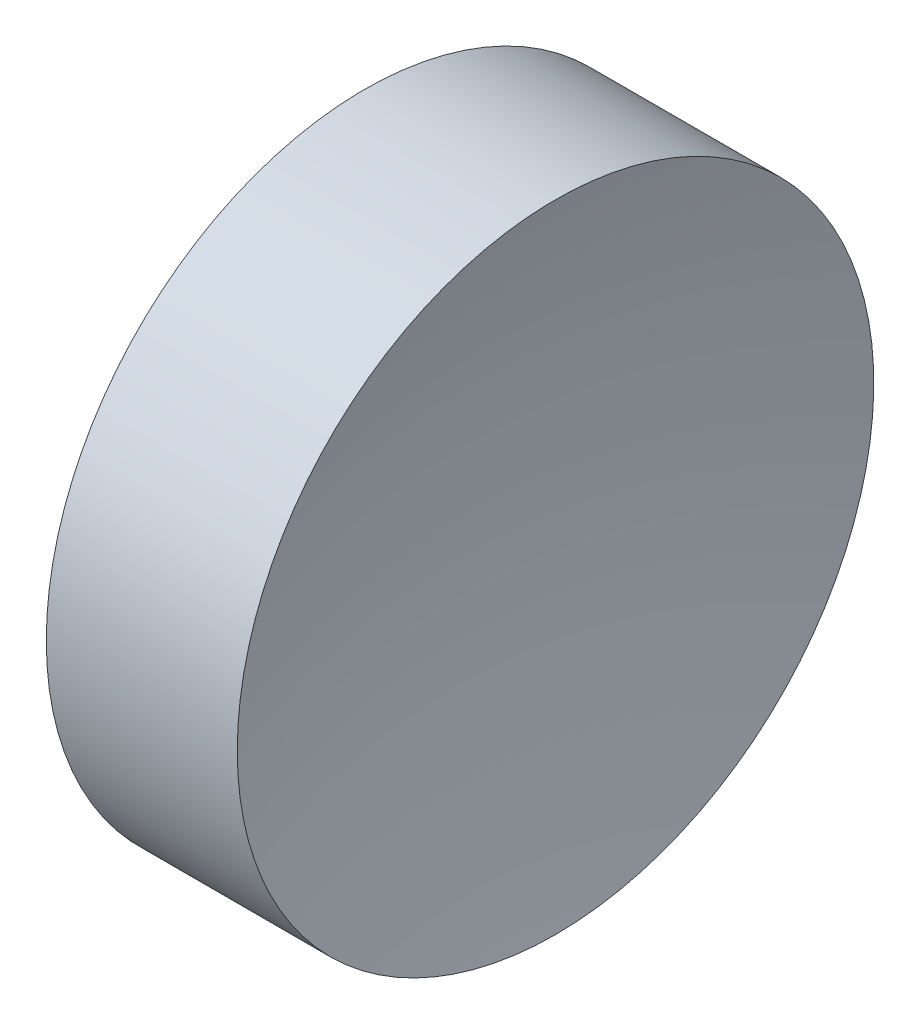
ISO-10303-21;
HEADER;
FILE_DESCRIPTION(('STEP AP214'),'2;1');
FILE_NAME('part.step','',(''),(''),'','','');
FILE_SCHEMA(('AUTOMOTIVE_DESIGN { 1 0 10303 214 1 1 1 1 }'));
ENDSEC;
DATA;
#1=APPLICATION_CONTEXT('core data for automotive mechanical design processes');
#2=APPLICATION_PROTOCOL_DEFINITION('international standard','automotive_design',2000,#1);
#3=PRODUCT_CONTEXT('',#1,'mechanical');
#4=PRODUCT('Part','Part','',(#3));
#5=PRODUCT_RELATED_PRODUCT_CATEGORY('part','',(#4));
#6=PRODUCT_DEFINITION_FORMATION('','',#4);
#7=PRODUCT_DEFINITION_CONTEXT('part definition',#1,'design');
#8=PRODUCT_DEFINITION('design','',#6,#7);
#9=PRODUCT_DEFINITION_SHAPE('','',#8);
#10=(LENGTH_UNIT() NAMED_UNIT(*) SI_UNIT(.MILLI.,.METRE.));
#11=(NAMED_UNIT(*) PLANE_ANGLE_UNIT() SI_UNIT($,.RADIAN.));
#12=(NAMED_UNIT(*) SI_UNIT($,.STERADIAN.) SOLID_ANGLE_UNIT());
#13=UNCERTAINTY_MEASURE_WITH_UNIT(LENGTH_MEASURE(1.E-05),#10,'distance_accuracy_value','');
#14=(GEOMETRIC_REPRESENTATION_CONTEXT(3) GLOBAL_UNCERTAINTY_ASSIGNED_CONTEXT((#13)) GLOBAL_UNIT_ASSIGNED_CONTEXT((#10,
#11,#12)) REPRESENTATION_CONTEXT('',''));
#15=CARTESIAN_POINT('',(0.,0.,0.));
#16=DIRECTION('',(0.,0.,1.));
#17=DIRECTION('',(1.,0.,0.));
#18=AXIS2_PLACEMENT_3D('',#15,#16,#17);
#19=CARTESIAN_POINT('',(36.7192688325745,13.031126091403,0.));
#20=DIRECTION('',(-1.,0.,0.));
#21=DIRECTION('',(0.,-1.,0.));
#22=AXIS2_PLACEMENT_3D('',#19,#20,#21);
#23=SPHERICAL_SURFACE('',#22,12.91);
#24=CARTESIAN_POINT('',(24.1994605273328,13.031126091403,0.));
#25=DIRECTION('',(-1.,0.,0.));
#26=DIRECTION('',(0.,0.,1.));
#27=AXIS2_PLACEMENT_3D('',#24,#25,#26);
#28=CIRCLE('',#27,3.15);
#29=CARTESIAN_POINT('',(24.1994605273328,13.031126091403,3.15));
#30=VERTEX_POINT('',#29);
#31=EDGE_CURVE('E10',#30,#30,#28,.T.);
#32=ORIENTED_EDGE('',*,*,#31,.F.);
#33=EDGE_LOOP('',(#32));
#34=FACE_BOUND('',#33,.T.);
#35=ADVANCED_FACE('F35',(#34),#23,.F.);
#36=CARTESIAN_POINT('',(20.6840306351329,13.031126091403,0.));
#37=DIRECTION('',(-1.,0.,0.));
#38=DIRECTION('',(0.,0.,1.));
#39=AXIS2_PLACEMENT_3D('',#36,#37,#38);
#40=CYLINDRICAL_SURFACE('',#39,3.15);
#41=CARTESIAN_POINT('',(22.3092688325745,13.031126091403,0.));
#42=DIRECTION('',(-1.,0.,0.));
#43=DIRECTION('',(0.,0.,1.));
#44=AXIS2_PLACEMENT_3D('',#41,#42,#43);
#45=CIRCLE('',#44,3.15);
#46=CARTESIAN_POINT('',(22.3092688325745,13.031126091403,3.15));
#47=VERTEX_POINT('',#46);
#48=EDGE_CURVE('E41',#47,#47,#45,.T.);
#49=ORIENTED_EDGE('',*,*,#48,.F.);
#50=EDGE_LOOP('',(#49));
#51=FACE_BOUND('',#50,.T.);
#52=ORIENTED_EDGE('',*,*,#31,.T.);
#53=EDGE_LOOP('',(#52));
#54=FACE_BOUND('',#53,.T.);
#55=ADVANCED_FACE('F49',(#51,#54),#40,.T.);
#56=CARTESIAN_POINT('',(22.3092688325745,13.031126091403,0.));
#57=DIRECTION('',(1.,0.,0.));
#58=DIRECTION('',(0.,0.,-1.));
#59=AXIS2_PLACEMENT_3D('',#56,#57,#58);
#60=PLANE('',#59);
#61=ORIENTED_EDGE('',*,*,#48,.T.);
#62=EDGE_LOOP('',(#61));
#63=FACE_BOUND('',#62,.T.);
#64=ADVANCED_FACE('F47',(#63),#60,.F.);
#65=CLOSED_SHELL('',(#35,#55,#64));
#66=MANIFOLD_SOLID_BREP('B2',#65);
#67=ADVANCED_BREP_SHAPE_REPRESENTATION('',(#18,#66),#14);
#68=SHAPE_DEFINITION_REPRESENTATION(#9,#67);
ENDSEC;
END-ISO-10303-21;
